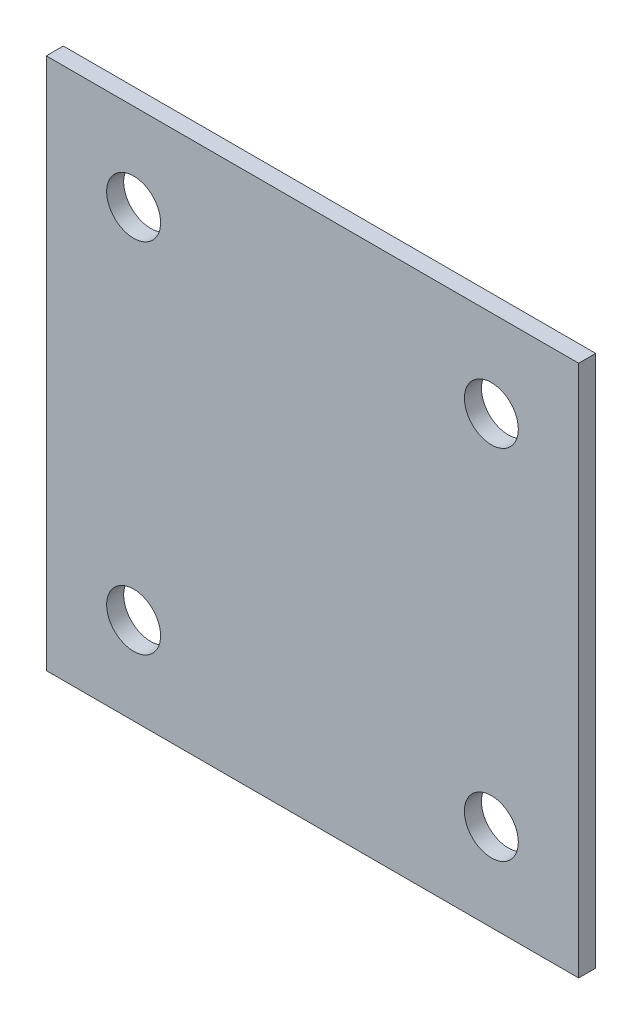
ISO-10303-21;
HEADER;
FILE_DESCRIPTION(('STEP AP214'),'2;1');
FILE_NAME('part.step','',(''),(''),'','','');
FILE_SCHEMA(('AUTOMOTIVE_DESIGN { 1 0 10303 214 1 1 1 1 }'));
ENDSEC;
DATA;
#1=APPLICATION_CONTEXT('core data for automotive mechanical design processes');
#2=APPLICATION_PROTOCOL_DEFINITION('international standard','automotive_design',2000,#1);
#3=PRODUCT_CONTEXT('',#1,'mechanical');
#4=PRODUCT('Part','Part','',(#3));
#5=PRODUCT_RELATED_PRODUCT_CATEGORY('part','',(#4));
#6=PRODUCT_DEFINITION_FORMATION('','',#4);
#7=PRODUCT_DEFINITION_CONTEXT('part definition',#1,'design');
#8=PRODUCT_DEFINITION('design','',#6,#7);
#9=PRODUCT_DEFINITION_SHAPE('','',#8);
#10=(LENGTH_UNIT() NAMED_UNIT(*) SI_UNIT(.MILLI.,.METRE.));
#11=(NAMED_UNIT(*) PLANE_ANGLE_UNIT() SI_UNIT($,.RADIAN.));
#12=(NAMED_UNIT(*) SI_UNIT($,.STERADIAN.) SOLID_ANGLE_UNIT());
#13=UNCERTAINTY_MEASURE_WITH_UNIT(LENGTH_MEASURE(1.E-05),#10,'distance_accuracy_value','');
#14=(GEOMETRIC_REPRESENTATION_CONTEXT(3) GLOBAL_UNCERTAINTY_ASSIGNED_CONTEXT((#13)) GLOBAL_UNIT_ASSIGNED_CONTEXT((#10,
#11,#12)) REPRESENTATION_CONTEXT('',''));
#15=CARTESIAN_POINT('',(0.,0.,0.));
#16=DIRECTION('',(0.,0.,1.));
#17=DIRECTION('',(1.,0.,0.));
#18=AXIS2_PLACEMENT_3D('',#15,#16,#17);
#19=CARTESIAN_POINT('',(-23.8125,23.8125,-1.524));
#20=DIRECTION('',(-1.,0.,0.));
#21=DIRECTION('',(0.,-1.,0.));
#22=AXIS2_PLACEMENT_3D('',#19,#20,#21);
#23=PLANE('',#22);
#24=DIRECTION('',(0.,-1.,0.));
#25=VECTOR('',#24,1.);
#26=CARTESIAN_POINT('',(-23.8125,23.8125,0.));
#27=LINE('',#26,#25);
#28=CARTESIAN_POINT('',(-23.8125,23.8125,0.));
#29=VERTEX_POINT('',#28);
#30=CARTESIAN_POINT('',(-23.8125,-23.8125,0.));
#31=VERTEX_POINT('',#30);
#32=EDGE_CURVE('E101',#29,#31,#27,.T.);
#33=ORIENTED_EDGE('',*,*,#32,.F.);
#34=DIRECTION('',(0.,0.,1.));
#35=VECTOR('',#34,1.);
#36=CARTESIAN_POINT('',(-23.8125,23.8125,-1.524));
#37=LINE('',#36,#35);
#38=CARTESIAN_POINT('',(-23.8125,23.8125,-1.524));
#39=VERTEX_POINT('',#38);
#40=EDGE_CURVE('E11',#39,#29,#37,.T.);
#41=ORIENTED_EDGE('',*,*,#40,.F.);
#42=DIRECTION('',(0.,-1.,0.));
#43=VECTOR('',#42,1.);
#44=CARTESIAN_POINT('',(-23.8125,23.8125,-1.524));
#45=LINE('',#44,#43);
#46=CARTESIAN_POINT('',(-23.8125,-23.8125,-1.524));
#47=VERTEX_POINT('',#46);
#48=EDGE_CURVE('E94',#39,#47,#45,.T.);
#49=ORIENTED_EDGE('',*,*,#48,.T.);
#50=DIRECTION('',(0.,0.,1.));
#51=VECTOR('',#50,1.);
#52=CARTESIAN_POINT('',(-23.8125,-23.8125,-1.524));
#53=LINE('',#52,#51);
#54=EDGE_CURVE('E39',#47,#31,#53,.T.);
#55=ORIENTED_EDGE('',*,*,#54,.T.);
#56=EDGE_LOOP('',(#33,#41,#49,#55));
#57=FACE_BOUND('',#56,.T.);
#58=ADVANCED_FACE('F36',(#57),#23,.T.);
#59=CARTESIAN_POINT('',(-23.8125,23.8125,-1.524));
#60=DIRECTION('',(0.,1.,0.));
#61=DIRECTION('',(0.,0.,1.));
#62=AXIS2_PLACEMENT_3D('',#59,#60,#61);
#63=PLANE('',#62);
#64=DIRECTION('',(-1.,0.,0.));
#65=VECTOR('',#64,1.);
#66=CARTESIAN_POINT('',(-23.8125,23.8125,0.));
#67=LINE('',#66,#65);
#68=CARTESIAN_POINT('',(23.8125,23.8125,0.));
#69=VERTEX_POINT('',#68);
#70=EDGE_CURVE('E96',#69,#29,#67,.T.);
#71=ORIENTED_EDGE('',*,*,#70,.F.);
#72=DIRECTION('',(0.,0.,1.));
#73=VECTOR('',#72,1.);
#74=CARTESIAN_POINT('',(23.8125,23.8125,-1.524));
#75=LINE('',#74,#73);
#76=CARTESIAN_POINT('',(23.8125,23.8125,-1.524));
#77=VERTEX_POINT('',#76);
#78=EDGE_CURVE('E45',#77,#69,#75,.T.);
#79=ORIENTED_EDGE('',*,*,#78,.F.);
#80=DIRECTION('',(-1.,0.,0.));
#81=VECTOR('',#80,1.);
#82=CARTESIAN_POINT('',(-23.8125,23.8125,-1.524));
#83=LINE('',#82,#81);
#84=EDGE_CURVE('E91',#77,#39,#83,.T.);
#85=ORIENTED_EDGE('',*,*,#84,.T.);
#86=ORIENTED_EDGE('',*,*,#40,.T.);
#87=EDGE_LOOP('',(#71,#79,#85,#86));
#88=FACE_BOUND('',#87,.T.);
#89=ADVANCED_FACE('F112',(#88),#63,.T.);
#90=CARTESIAN_POINT('',(23.8125,23.8125,-1.524));
#91=DIRECTION('',(1.,0.,0.));
#92=DIRECTION('',(0.,1.,0.));
#93=AXIS2_PLACEMENT_3D('',#90,#91,#92);
#94=PLANE('',#93);
#95=DIRECTION('',(0.,1.,0.));
#96=VECTOR('',#95,1.);
#97=CARTESIAN_POINT('',(23.8125,23.8125,0.));
#98=LINE('',#97,#96);
#99=CARTESIAN_POINT('',(23.8125,-23.8125,0.));
#100=VERTEX_POINT('',#99);
#101=EDGE_CURVE('E86',#100,#69,#98,.T.);
#102=ORIENTED_EDGE('',*,*,#101,.F.);
#103=DIRECTION('',(0.,0.,1.));
#104=VECTOR('',#103,1.);
#105=CARTESIAN_POINT('',(23.8125,-23.8125,-1.524));
#106=LINE('',#105,#104);
#107=CARTESIAN_POINT('',(23.8125,-23.8125,-1.524));
#108=VERTEX_POINT('',#107);
#109=EDGE_CURVE('E81',#108,#100,#106,.T.);
#110=ORIENTED_EDGE('',*,*,#109,.F.);
#111=DIRECTION('',(0.,1.,0.));
#112=VECTOR('',#111,1.);
#113=CARTESIAN_POINT('',(23.8125,23.8125,-1.524));
#114=LINE('',#113,#112);
#115=EDGE_CURVE('E84',#108,#77,#114,.T.);
#116=ORIENTED_EDGE('',*,*,#115,.T.);
#117=ORIENTED_EDGE('',*,*,#78,.T.);
#118=EDGE_LOOP('',(#102,#110,#116,#117));
#119=FACE_BOUND('',#118,.T.);
#120=ADVANCED_FACE('F83',(#119),#94,.T.);
#121=CARTESIAN_POINT('',(-23.8125,-23.8125,-1.524));
#122=DIRECTION('',(0.,-1.,0.));
#123=DIRECTION('',(0.,0.,-1.));
#124=AXIS2_PLACEMENT_3D('',#121,#122,#123);
#125=PLANE('',#124);
#126=DIRECTION('',(1.,0.,0.));
#127=VECTOR('',#126,1.);
#128=CARTESIAN_POINT('',(-23.8125,-23.8125,0.));
#129=LINE('',#128,#127);
#130=EDGE_CURVE('E104',#31,#100,#129,.T.);
#131=ORIENTED_EDGE('',*,*,#130,.F.);
#132=ORIENTED_EDGE('',*,*,#54,.F.);
#133=DIRECTION('',(1.,0.,0.));
#134=VECTOR('',#133,1.);
#135=CARTESIAN_POINT('',(-23.8125,-23.8125,-1.524));
#136=LINE('',#135,#134);
#137=EDGE_CURVE('E90',#47,#108,#136,.T.);
#138=ORIENTED_EDGE('',*,*,#137,.T.);
#139=ORIENTED_EDGE('',*,*,#109,.T.);
#140=EDGE_LOOP('',(#131,#132,#138,#139));
#141=FACE_BOUND('',#140,.T.);
#142=ADVANCED_FACE('F93',(#141),#125,.T.);
#143=CARTESIAN_POINT('',(-23.8125,-23.8125,-1.524));
#144=DIRECTION('',(0.,0.,1.));
#145=DIRECTION('',(1.,0.,0.));
#146=AXIS2_PLACEMENT_3D('',#143,#144,#145);
#147=PLANE('',#146);
#148=CARTESIAN_POINT('',(16.,-16.,-1.524));
#149=DIRECTION('',(0.,0.,1.));
#150=DIRECTION('',(1.,0.,0.));
#151=AXIS2_PLACEMENT_3D('',#148,#149,#150);
#152=CIRCLE('',#151,2.413);
#153=CARTESIAN_POINT('',(18.413,-16.,-1.524));
#154=VERTEX_POINT('',#153);
#155=EDGE_CURVE('E153',#154,#154,#152,.T.);
#156=ORIENTED_EDGE('',*,*,#155,.T.);
#157=EDGE_LOOP('',(#156));
#158=FACE_BOUND('',#157,.T.);
#159=CARTESIAN_POINT('',(-16.,-16.,-1.524));
#160=DIRECTION('',(0.,0.,1.));
#161=DIRECTION('',(1.,0.,0.));
#162=AXIS2_PLACEMENT_3D('',#159,#160,#161);
#163=CIRCLE('',#162,2.413);
#164=CARTESIAN_POINT('',(-13.587,-16.,-1.524));
#165=VERTEX_POINT('',#164);
#166=EDGE_CURVE('E161',#165,#165,#163,.T.);
#167=ORIENTED_EDGE('',*,*,#166,.T.);
#168=EDGE_LOOP('',(#167));
#169=FACE_BOUND('',#168,.T.);
#170=CARTESIAN_POINT('',(16.,16.,-1.524));
#171=DIRECTION('',(0.,0.,1.));
#172=DIRECTION('',(1.,0.,0.));
#173=AXIS2_PLACEMENT_3D('',#170,#171,#172);
#174=CIRCLE('',#173,2.413);
#175=CARTESIAN_POINT('',(18.413,16.,-1.524));
#176=VERTEX_POINT('',#175);
#177=EDGE_CURVE('E167',#176,#176,#174,.T.);
#178=ORIENTED_EDGE('',*,*,#177,.T.);
#179=EDGE_LOOP('',(#178));
#180=FACE_BOUND('',#179,.T.);
#181=CARTESIAN_POINT('',(-16.,16.,-1.524));
#182=DIRECTION('',(0.,0.,1.));
#183=DIRECTION('',(1.,0.,0.));
#184=AXIS2_PLACEMENT_3D('',#181,#182,#183);
#185=CIRCLE('',#184,2.413);
#186=CARTESIAN_POINT('',(-13.587,16.,-1.524));
#187=VERTEX_POINT('',#186);
#188=EDGE_CURVE('E105',#187,#187,#185,.T.);
#189=ORIENTED_EDGE('',*,*,#188,.T.);
#190=EDGE_LOOP('',(#189));
#191=FACE_BOUND('',#190,.T.);
#192=ORIENTED_EDGE('',*,*,#48,.F.);
#193=ORIENTED_EDGE('',*,*,#84,.F.);
#194=ORIENTED_EDGE('',*,*,#115,.F.);
#195=ORIENTED_EDGE('',*,*,#137,.F.);
#196=EDGE_LOOP('',(#192,#193,#194,#195));
#197=FACE_BOUND('',#196,.T.);
#198=ADVANCED_FACE('F89',(#158,#169,#180,#191,#197),#147,.F.);
#199=CARTESIAN_POINT('',(-23.8125,-23.8125,0.));
#200=DIRECTION('',(0.,0.,1.));
#201=DIRECTION('',(1.,0.,0.));
#202=AXIS2_PLACEMENT_3D('',#199,#200,#201);
#203=PLANE('',#202);
#204=CARTESIAN_POINT('',(16.,-16.,0.));
#205=DIRECTION('',(0.,0.,1.));
#206=DIRECTION('',(1.,0.,0.));
#207=AXIS2_PLACEMENT_3D('',#204,#205,#206);
#208=CIRCLE('',#207,2.413);
#209=CARTESIAN_POINT('',(18.413,-16.,0.));
#210=VERTEX_POINT('',#209);
#211=EDGE_CURVE('E156',#210,#210,#208,.T.);
#212=ORIENTED_EDGE('',*,*,#211,.F.);
#213=EDGE_LOOP('',(#212));
#214=FACE_BOUND('',#213,.T.);
#215=CARTESIAN_POINT('',(-16.,-16.,0.));
#216=DIRECTION('',(0.,0.,1.));
#217=DIRECTION('',(1.,0.,0.));
#218=AXIS2_PLACEMENT_3D('',#215,#216,#217);
#219=CIRCLE('',#218,2.413);
#220=CARTESIAN_POINT('',(-13.587,-16.,0.));
#221=VERTEX_POINT('',#220);
#222=EDGE_CURVE('E158',#221,#221,#219,.T.);
#223=ORIENTED_EDGE('',*,*,#222,.F.);
#224=EDGE_LOOP('',(#223));
#225=FACE_BOUND('',#224,.T.);
#226=CARTESIAN_POINT('',(16.,16.,0.));
#227=DIRECTION('',(0.,0.,1.));
#228=DIRECTION('',(1.,0.,0.));
#229=AXIS2_PLACEMENT_3D('',#226,#227,#228);
#230=CIRCLE('',#229,2.413);
#231=CARTESIAN_POINT('',(18.413,16.,0.));
#232=VERTEX_POINT('',#231);
#233=EDGE_CURVE('E164',#232,#232,#230,.T.);
#234=ORIENTED_EDGE('',*,*,#233,.F.);
#235=EDGE_LOOP('',(#234));
#236=FACE_BOUND('',#235,.T.);
#237=CARTESIAN_POINT('',(-16.,16.,0.));
#238=DIRECTION('',(0.,0.,1.));
#239=DIRECTION('',(1.,0.,0.));
#240=AXIS2_PLACEMENT_3D('',#237,#238,#239);
#241=CIRCLE('',#240,2.413);
#242=CARTESIAN_POINT('',(-13.587,16.,0.));
#243=VERTEX_POINT('',#242);
#244=EDGE_CURVE('E170',#243,#243,#241,.T.);
#245=ORIENTED_EDGE('',*,*,#244,.F.);
#246=EDGE_LOOP('',(#245));
#247=FACE_BOUND('',#246,.T.);
#248=ORIENTED_EDGE('',*,*,#32,.T.);
#249=ORIENTED_EDGE('',*,*,#130,.T.);
#250=ORIENTED_EDGE('',*,*,#101,.T.);
#251=ORIENTED_EDGE('',*,*,#70,.T.);
#252=EDGE_LOOP('',(#248,#249,#250,#251));
#253=FACE_BOUND('',#252,.T.);
#254=ADVANCED_FACE('F111',(#214,#225,#236,#247,#253),#203,.T.);
#255=CARTESIAN_POINT('',(-16.,16.,-1.524));
#256=DIRECTION('',(0.,0.,1.));
#257=DIRECTION('',(1.,0.,0.));
#258=AXIS2_PLACEMENT_3D('',#255,#256,#257);
#259=CYLINDRICAL_SURFACE('',#258,2.413);
#260=ORIENTED_EDGE('',*,*,#188,.F.);
#261=EDGE_LOOP('',(#260));
#262=FACE_BOUND('',#261,.T.);
#263=ORIENTED_EDGE('',*,*,#244,.T.);
#264=EDGE_LOOP('',(#263));
#265=FACE_BOUND('',#264,.T.);
#266=ADVANCED_FACE('F130',(#262,#265),#259,.F.);
#267=CARTESIAN_POINT('',(16.,16.,-1.524));
#268=DIRECTION('',(0.,0.,1.));
#269=DIRECTION('',(1.,0.,0.));
#270=AXIS2_PLACEMENT_3D('',#267,#268,#269);
#271=CYLINDRICAL_SURFACE('',#270,2.413);
#272=ORIENTED_EDGE('',*,*,#177,.F.);
#273=EDGE_LOOP('',(#272));
#274=FACE_BOUND('',#273,.T.);
#275=ORIENTED_EDGE('',*,*,#233,.T.);
#276=EDGE_LOOP('',(#275));
#277=FACE_BOUND('',#276,.T.);
#278=ADVANCED_FACE('F137',(#274,#277),#271,.F.);
#279=CARTESIAN_POINT('',(-16.,-16.,-1.524));
#280=DIRECTION('',(0.,0.,1.));
#281=DIRECTION('',(1.,0.,0.));
#282=AXIS2_PLACEMENT_3D('',#279,#280,#281);
#283=CYLINDRICAL_SURFACE('',#282,2.413);
#284=ORIENTED_EDGE('',*,*,#166,.F.);
#285=EDGE_LOOP('',(#284));
#286=FACE_BOUND('',#285,.T.);
#287=ORIENTED_EDGE('',*,*,#222,.T.);
#288=EDGE_LOOP('',(#287));
#289=FACE_BOUND('',#288,.T.);
#290=ADVANCED_FACE('F141',(#286,#289),#283,.F.);
#291=CARTESIAN_POINT('',(16.,-16.,-1.524));
#292=DIRECTION('',(0.,0.,1.));
#293=DIRECTION('',(1.,0.,0.));
#294=AXIS2_PLACEMENT_3D('',#291,#292,#293);
#295=CYLINDRICAL_SURFACE('',#294,2.413);
#296=ORIENTED_EDGE('',*,*,#155,.F.);
#297=EDGE_LOOP('',(#296));
#298=FACE_BOUND('',#297,.T.);
#299=ORIENTED_EDGE('',*,*,#211,.T.);
#300=EDGE_LOOP('',(#299));
#301=FACE_BOUND('',#300,.T.);
#302=ADVANCED_FACE('F145',(#298,#301),#295,.F.);
#303=CLOSED_SHELL('',(#58,#89,#120,#142,#198,#254,#266,#278,#290,#302));
#304=MANIFOLD_SOLID_BREP('B2',#303);
#305=ADVANCED_BREP_SHAPE_REPRESENTATION('',(#18,#304),#14);
#306=SHAPE_DEFINITION_REPRESENTATION(#9,#305);
ENDSEC;
END-ISO-10303-21;
